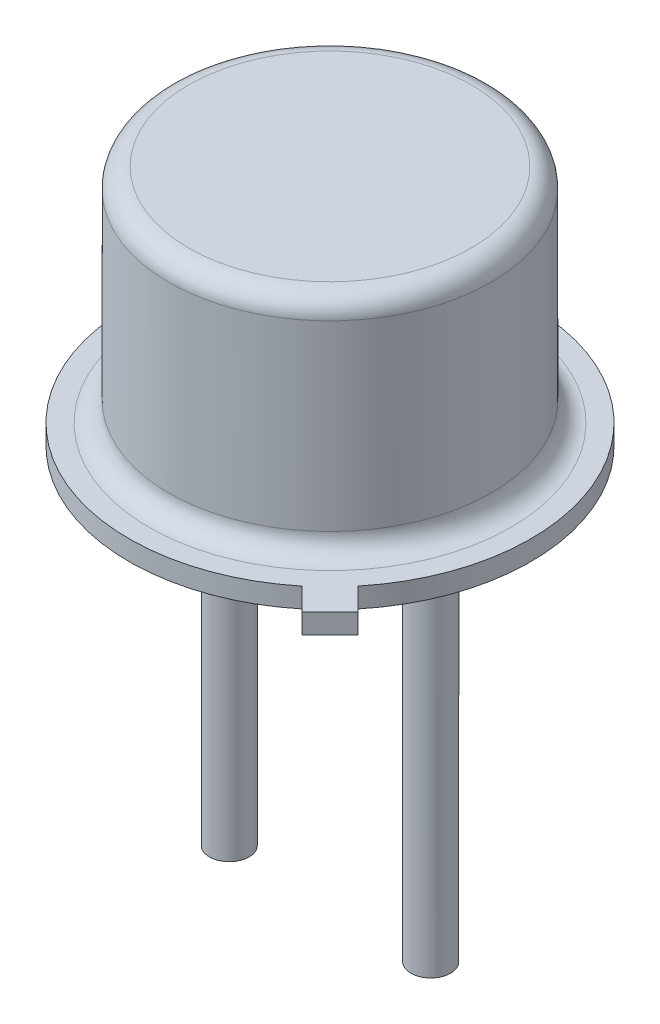
ISO-10303-21;
HEADER;
FILE_DESCRIPTION(('STEP AP214'),'2;1');
FILE_NAME('part.step','',(''),(''),'','','');
FILE_SCHEMA(('AUTOMOTIVE_DESIGN { 1 0 10303 214 1 1 1 1 }'));
ENDSEC;
DATA;
#1=APPLICATION_CONTEXT('core data for automotive mechanical design processes');
#2=APPLICATION_PROTOCOL_DEFINITION('international standard','automotive_design',2000,#1);
#3=PRODUCT_CONTEXT('',#1,'mechanical');
#4=PRODUCT('Part','Part','',(#3));
#5=PRODUCT_RELATED_PRODUCT_CATEGORY('part','',(#4));
#6=PRODUCT_DEFINITION_FORMATION('','',#4);
#7=PRODUCT_DEFINITION_CONTEXT('part definition',#1,'design');
#8=PRODUCT_DEFINITION('design','',#6,#7);
#9=PRODUCT_DEFINITION_SHAPE('','',#8);
#10=(LENGTH_UNIT() NAMED_UNIT(*) SI_UNIT(.MILLI.,.METRE.));
#11=(NAMED_UNIT(*) PLANE_ANGLE_UNIT() SI_UNIT($,.RADIAN.));
#12=(NAMED_UNIT(*) SI_UNIT($,.STERADIAN.) SOLID_ANGLE_UNIT());
#13=UNCERTAINTY_MEASURE_WITH_UNIT(LENGTH_MEASURE(1.E-05),#10,'distance_accuracy_value','');
#14=(GEOMETRIC_REPRESENTATION_CONTEXT(3) GLOBAL_UNCERTAINTY_ASSIGNED_CONTEXT((#13)) GLOBAL_UNIT_ASSIGNED_CONTEXT((#10,
#11,#12)) REPRESENTATION_CONTEXT('',''));
#15=CARTESIAN_POINT('',(0.,0.,0.));
#16=DIRECTION('',(0.,0.,1.));
#17=DIRECTION('',(1.,0.,0.));
#18=AXIS2_PLACEMENT_3D('',#15,#16,#17);
#19=CARTESIAN_POINT('',(-2.54,4.06,0.));
#20=DIRECTION('',(0.,1.,0.));
#21=DIRECTION('',(0.,0.,1.));
#22=AXIS2_PLACEMENT_3D('',#19,#20,#21);
#23=PLANE('',#22);
#24=CARTESIAN_POINT('',(-2.54,4.06,-2.54));
#25=DIRECTION('',(0.,1.,0.));
#26=DIRECTION('',(0.,0.,1.));
#27=AXIS2_PLACEMENT_3D('',#24,#25,#26);
#28=CIRCLE('',#27,0.5);
#29=CARTESIAN_POINT('',(-2.54,4.06,-2.04));
#30=VERTEX_POINT('',#29);
#31=EDGE_CURVE('E122',#30,#30,#28,.F.);
#32=ORIENTED_EDGE('',*,*,#31,.F.);
#33=EDGE_LOOP('',(#32));
#34=FACE_BOUND('',#33,.T.);
#35=CARTESIAN_POINT('',(0.,4.06,0.));
#36=DIRECTION('',(0.,1.,0.));
#37=DIRECTION('',(0.,0.,1.));
#38=AXIS2_PLACEMENT_3D('',#35,#36,#37);
#39=CIRCLE('',#38,0.5);
#40=CARTESIAN_POINT('',(0.,4.06,0.5));
#41=VERTEX_POINT('',#40);
#42=EDGE_CURVE('E119',#41,#41,#39,.F.);
#43=ORIENTED_EDGE('',*,*,#42,.F.);
#44=EDGE_LOOP('',(#43));
#45=FACE_BOUND('',#44,.T.);
#46=CARTESIAN_POINT('',(-5.08,4.06,0.));
#47=DIRECTION('',(0.,1.,0.));
#48=DIRECTION('',(0.,0.,1.));
#49=AXIS2_PLACEMENT_3D('',#46,#47,#48);
#50=CIRCLE('',#49,0.5);
#51=CARTESIAN_POINT('',(-5.08,4.06,0.5));
#52=VERTEX_POINT('',#51);
#53=EDGE_CURVE('E125',#52,#52,#50,.F.);
#54=ORIENTED_EDGE('',*,*,#53,.F.);
#55=EDGE_LOOP('',(#54));
#56=FACE_BOUND('',#55,.T.);
#57=DIRECTION('',(-0.707106781186548,0.,-0.707106781186547));
#58=VECTOR('',#57,1.);
#59=CARTESIAN_POINT('',(1.23613434917003,4.06,4.48324113035658));
#60=LINE('',#59,#58);
#61=CARTESIAN_POINT('',(1.23613434917003,4.06,4.48324113035658));
#62=VERTEX_POINT('',#61);
#63=CARTESIAN_POINT('',(0.670448924220787,4.06,3.91755570540734));
#64=VERTEX_POINT('',#63);
#65=EDGE_CURVE('E99',#62,#64,#60,.T.);
#66=ORIENTED_EDGE('',*,*,#65,.T.);
#67=CARTESIAN_POINT('',(-2.54,4.06,0.));
#68=DIRECTION('',(0.,-1.,0.));
#69=DIRECTION('',(0.,0.,-1.));
#70=AXIS2_PLACEMENT_3D('',#67,#68,#69);
#71=CIRCLE('',#70,5.065);
#72=CARTESIAN_POINT('',(1.37755570540734,4.06,3.21044892422079));
#73=VERTEX_POINT('',#72);
#74=EDGE_CURVE('E102',#64,#73,#71,.T.);
#75=ORIENTED_EDGE('',*,*,#74,.T.);
#76=DIRECTION('',(0.707106781186547,0.,0.707106781186548));
#77=VECTOR('',#76,1.);
#78=CARTESIAN_POINT('',(1.94324113035657,4.06,3.77613434917003));
#79=LINE('',#78,#77);
#80=CARTESIAN_POINT('',(1.94324113035657,4.06,3.77613434917003));
#81=VERTEX_POINT('',#80);
#82=EDGE_CURVE('E84',#73,#81,#79,.T.);
#83=ORIENTED_EDGE('',*,*,#82,.T.);
#84=DIRECTION('',(-0.707106781186547,0.,0.707106781186547));
#85=VECTOR('',#84,1.);
#86=CARTESIAN_POINT('',(1.23613434917003,4.06,4.48324113035658));
#87=LINE('',#86,#85);
#88=EDGE_CURVE('E95',#81,#62,#87,.T.);
#89=ORIENTED_EDGE('',*,*,#88,.T.);
#90=EDGE_LOOP('',(#66,#75,#83,#89));
#91=FACE_BOUND('',#90,.T.);
#92=ADVANCED_FACE('F31',(#34,#45,#56,#91),#23,.F.);
#93=CARTESIAN_POINT('',(0.,-5.94,0.));
#94=DIRECTION('',(0.,1.,0.));
#95=DIRECTION('',(0.,0.,1.));
#96=AXIS2_PLACEMENT_3D('',#93,#94,#95);
#97=CYLINDRICAL_SURFACE('',#96,0.5);
#98=CARTESIAN_POINT('',(0.,-5.94,0.));
#99=DIRECTION('',(0.,-1.,0.));
#100=DIRECTION('',(0.,0.,-1.));
#101=AXIS2_PLACEMENT_3D('',#98,#99,#100);
#102=CIRCLE('',#101,0.5);
#103=CARTESIAN_POINT('',(0.,-5.94,-0.5));
#104=VERTEX_POINT('',#103);
#105=EDGE_CURVE('E116',#104,#104,#102,.T.);
#106=ORIENTED_EDGE('',*,*,#105,.F.);
#107=EDGE_LOOP('',(#106));
#108=FACE_BOUND('',#107,.T.);
#109=ORIENTED_EDGE('',*,*,#42,.T.);
#110=EDGE_LOOP('',(#109));
#111=FACE_BOUND('',#110,.T.);
#112=ADVANCED_FACE('F156',(#108,#111),#97,.T.);
#113=CARTESIAN_POINT('',(0.,-5.94,0.));
#114=DIRECTION('',(0.,-1.,0.));
#115=DIRECTION('',(0.,0.,-1.));
#116=AXIS2_PLACEMENT_3D('',#113,#114,#115);
#117=PLANE('',#116);
#118=ORIENTED_EDGE('',*,*,#105,.T.);
#119=EDGE_LOOP('',(#118));
#120=FACE_BOUND('',#119,.T.);
#121=ADVANCED_FACE('F161',(#120),#117,.T.);
#122=CARTESIAN_POINT('',(-2.54,-5.94,-2.54));
#123=DIRECTION('',(0.,1.,0.));
#124=DIRECTION('',(0.,0.,1.));
#125=AXIS2_PLACEMENT_3D('',#122,#123,#124);
#126=CYLINDRICAL_SURFACE('',#125,0.5);
#127=CARTESIAN_POINT('',(-2.54,-5.94,-2.54));
#128=DIRECTION('',(0.,-1.,0.));
#129=DIRECTION('',(0.,0.,-1.));
#130=AXIS2_PLACEMENT_3D('',#127,#128,#129);
#131=CIRCLE('',#130,0.5);
#132=CARTESIAN_POINT('',(-2.54,-5.94,-3.04));
#133=VERTEX_POINT('',#132);
#134=EDGE_CURVE('E113',#133,#133,#131,.T.);
#135=ORIENTED_EDGE('',*,*,#134,.F.);
#136=EDGE_LOOP('',(#135));
#137=FACE_BOUND('',#136,.T.);
#138=ORIENTED_EDGE('',*,*,#31,.T.);
#139=EDGE_LOOP('',(#138));
#140=FACE_BOUND('',#139,.T.);
#141=ADVANCED_FACE('F192',(#137,#140),#126,.T.);
#142=CARTESIAN_POINT('',(-2.54,-5.94,-2.54));
#143=DIRECTION('',(0.,-1.,0.));
#144=DIRECTION('',(0.,0.,-1.));
#145=AXIS2_PLACEMENT_3D('',#142,#143,#144);
#146=PLANE('',#145);
#147=ORIENTED_EDGE('',*,*,#134,.T.);
#148=EDGE_LOOP('',(#147));
#149=FACE_BOUND('',#148,.T.);
#150=ADVANCED_FACE('F188',(#149),#146,.T.);
#151=CARTESIAN_POINT('',(-5.08,-5.94,0.));
#152=DIRECTION('',(0.,1.,0.));
#153=DIRECTION('',(0.,0.,1.));
#154=AXIS2_PLACEMENT_3D('',#151,#152,#153);
#155=CYLINDRICAL_SURFACE('',#154,0.5);
#156=CARTESIAN_POINT('',(-5.08,-5.94,0.));
#157=DIRECTION('',(0.,-1.,0.));
#158=DIRECTION('',(0.,0.,1.));
#159=AXIS2_PLACEMENT_3D('',#156,#157,#158);
#160=CIRCLE('',#159,0.5);
#161=CARTESIAN_POINT('',(-5.08,-5.94,0.5));
#162=VERTEX_POINT('',#161);
#163=EDGE_CURVE('E108',#162,#162,#160,.T.);
#164=ORIENTED_EDGE('',*,*,#163,.F.);
#165=EDGE_LOOP('',(#164));
#166=FACE_BOUND('',#165,.T.);
#167=ORIENTED_EDGE('',*,*,#53,.T.);
#168=EDGE_LOOP('',(#167));
#169=FACE_BOUND('',#168,.T.);
#170=ADVANCED_FACE('F184',(#166,#169),#155,.T.);
#171=CARTESIAN_POINT('',(-5.08,-5.94,0.));
#172=DIRECTION('',(0.,1.,0.));
#173=DIRECTION('',(0.,0.,1.));
#174=AXIS2_PLACEMENT_3D('',#171,#172,#173);
#175=PLANE('',#174);
#176=ORIENTED_EDGE('',*,*,#163,.T.);
#177=EDGE_LOOP('',(#176));
#178=FACE_BOUND('',#177,.T.);
#179=ADVANCED_FACE('F181',(#178),#175,.F.);
#180=CARTESIAN_POINT('',(-2.54,4.56,0.));
#181=DIRECTION('',(0.,-1.,0.));
#182=DIRECTION('',(0.,0.,-1.));
#183=AXIS2_PLACEMENT_3D('',#180,#181,#182);
#184=PLANE('',#183);
#185=CARTESIAN_POINT('',(-2.54,4.56,0.));
#186=DIRECTION('',(0.,-1.,0.));
#187=DIRECTION('',(0.,0.,-1.));
#188=AXIS2_PLACEMENT_3D('',#185,#186,#187);
#189=CIRCLE('',#188,4.564);
#190=CARTESIAN_POINT('',(-2.54,4.56,-4.564));
#191=VERTEX_POINT('',#190);
#192=EDGE_CURVE('E11',#191,#191,#189,.T.);
#193=ORIENTED_EDGE('',*,*,#192,.T.);
#194=EDGE_LOOP('',(#193));
#195=FACE_BOUND('',#194,.T.);
#196=DIRECTION('',(-0.707106781186548,0.,-0.707106781186547));
#197=VECTOR('',#196,1.);
#198=CARTESIAN_POINT('',(1.23613434917003,4.56,4.48324113035658));
#199=LINE('',#198,#197);
#200=CARTESIAN_POINT('',(1.23613434917003,4.56,4.48324113035658));
#201=VERTEX_POINT('',#200);
#202=CARTESIAN_POINT('',(0.670448924220787,4.56,3.91755570540734));
#203=VERTEX_POINT('',#202);
#204=EDGE_CURVE('E93',#201,#203,#199,.T.);
#205=ORIENTED_EDGE('',*,*,#204,.F.);
#206=DIRECTION('',(-0.707106781186547,0.,0.707106781186547));
#207=VECTOR('',#206,1.);
#208=CARTESIAN_POINT('',(1.23613434917003,4.56,4.48324113035658));
#209=LINE('',#208,#207);
#210=CARTESIAN_POINT('',(1.94324113035657,4.56,3.77613434917003));
#211=VERTEX_POINT('',#210);
#212=EDGE_CURVE('E90',#211,#201,#209,.T.);
#213=ORIENTED_EDGE('',*,*,#212,.F.);
#214=DIRECTION('',(0.707106781186547,0.,0.707106781186548));
#215=VECTOR('',#214,1.);
#216=CARTESIAN_POINT('',(1.94324113035657,4.56,3.77613434917003));
#217=LINE('',#216,#215);
#218=CARTESIAN_POINT('',(1.37755570540734,4.56,3.21044892422079));
#219=VERTEX_POINT('',#218);
#220=EDGE_CURVE('E82',#219,#211,#217,.T.);
#221=ORIENTED_EDGE('',*,*,#220,.F.);
#222=CARTESIAN_POINT('',(-2.54,4.56,0.));
#223=DIRECTION('',(0.,-1.,0.));
#224=DIRECTION('',(0.,0.,-1.));
#225=AXIS2_PLACEMENT_3D('',#222,#223,#224);
#226=CIRCLE('',#225,5.065);
#227=EDGE_CURVE('E89',#203,#219,#226,.T.);
#228=ORIENTED_EDGE('',*,*,#227,.F.);
#229=EDGE_LOOP('',(#205,#213,#221,#228));
#230=FACE_BOUND('',#229,.T.);
#231=ADVANCED_FACE('F88',(#195,#230),#184,.F.);
#232=CARTESIAN_POINT('',(1.23613434917003,4.56,4.48324113035658));
#233=DIRECTION('',(-0.707106781186547,0.,0.707106781186548));
#234=DIRECTION('',(0.707106781186548,0.,0.707106781186547));
#235=AXIS2_PLACEMENT_3D('',#232,#233,#234);
#236=PLANE('',#235);
#237=ORIENTED_EDGE('',*,*,#65,.F.);
#238=DIRECTION('',(0.,-1.,0.));
#239=VECTOR('',#238,1.);
#240=CARTESIAN_POINT('',(1.23613434917003,4.56,4.48324113035658));
#241=LINE('',#240,#239);
#242=EDGE_CURVE('E48',#201,#62,#241,.T.);
#243=ORIENTED_EDGE('',*,*,#242,.F.);
#244=ORIENTED_EDGE('',*,*,#204,.T.);
#245=DIRECTION('',(0.,-1.,0.));
#246=VECTOR('',#245,1.);
#247=CARTESIAN_POINT('',(0.670448924220787,4.56,3.91755570540734));
#248=LINE('',#247,#246);
#249=EDGE_CURVE('E76',#203,#64,#248,.T.);
#250=ORIENTED_EDGE('',*,*,#249,.T.);
#251=EDGE_LOOP('',(#237,#243,#244,#250));
#252=FACE_BOUND('',#251,.T.);
#253=ADVANCED_FACE('F169',(#252),#236,.T.);
#254=CARTESIAN_POINT('',(1.23613434917003,4.56,4.48324113035658));
#255=DIRECTION('',(0.707106781186547,0.,0.707106781186547));
#256=DIRECTION('',(0.707106781186548,0.,-0.707106781186548));
#257=AXIS2_PLACEMENT_3D('',#254,#255,#256);
#258=PLANE('',#257);
#259=ORIENTED_EDGE('',*,*,#88,.F.);
#260=DIRECTION('',(0.,-1.,0.));
#261=VECTOR('',#260,1.);
#262=CARTESIAN_POINT('',(1.94324113035657,4.56,3.77613434917003));
#263=LINE('',#262,#261);
#264=EDGE_CURVE('E65',#211,#81,#263,.T.);
#265=ORIENTED_EDGE('',*,*,#264,.F.);
#266=ORIENTED_EDGE('',*,*,#212,.T.);
#267=ORIENTED_EDGE('',*,*,#242,.T.);
#268=EDGE_LOOP('',(#259,#265,#266,#267));
#269=FACE_BOUND('',#268,.T.);
#270=ADVANCED_FACE('F170',(#269),#258,.T.);
#271=CARTESIAN_POINT('',(1.94324113035657,4.56,3.77613434917003));
#272=DIRECTION('',(0.707106781186548,0.,-0.707106781186547));
#273=DIRECTION('',(-0.707106781186547,0.,-0.707106781186548));
#274=AXIS2_PLACEMENT_3D('',#271,#272,#273);
#275=PLANE('',#274);
#276=ORIENTED_EDGE('',*,*,#82,.F.);
#277=DIRECTION('',(0.,-1.,0.));
#278=VECTOR('',#277,1.);
#279=CARTESIAN_POINT('',(1.37755570540734,4.56,3.21044892422079));
#280=LINE('',#279,#278);
#281=EDGE_CURVE('E79',#219,#73,#280,.T.);
#282=ORIENTED_EDGE('',*,*,#281,.F.);
#283=ORIENTED_EDGE('',*,*,#220,.T.);
#284=ORIENTED_EDGE('',*,*,#264,.T.);
#285=EDGE_LOOP('',(#276,#282,#283,#284));
#286=FACE_BOUND('',#285,.T.);
#287=ADVANCED_FACE('F81',(#286),#275,.T.);
#288=CARTESIAN_POINT('',(-2.54,4.56,0.));
#289=DIRECTION('',(0.,-1.,0.));
#290=DIRECTION('',(0.,0.,-1.));
#291=AXIS2_PLACEMENT_3D('',#288,#289,#290);
#292=CYLINDRICAL_SURFACE('',#291,5.065);
#293=ORIENTED_EDGE('',*,*,#74,.F.);
#294=ORIENTED_EDGE('',*,*,#249,.F.);
#295=ORIENTED_EDGE('',*,*,#227,.T.);
#296=ORIENTED_EDGE('',*,*,#281,.T.);
#297=EDGE_LOOP('',(#293,#294,#295,#296));
#298=FACE_BOUND('',#297,.T.);
#299=ADVANCED_FACE('F92',(#298),#292,.T.);
#300=CARTESIAN_POINT('',(-2.54,10.16,0.));
#301=DIRECTION('',(0.,1.,0.));
#302=DIRECTION('',(0.,0.,1.));
#303=AXIS2_PLACEMENT_3D('',#300,#301,#302);
#304=PLANE('',#303);
#305=CARTESIAN_POINT('',(-2.54,10.16,0.));
#306=DIRECTION('',(0.,1.,0.));
#307=DIRECTION('',(0.,0.,1.));
#308=AXIS2_PLACEMENT_3D('',#305,#306,#307);
#309=CIRCLE('',#308,3.564);
#310=CARTESIAN_POINT('',(-2.54,10.16,3.564));
#311=VERTEX_POINT('',#310);
#312=EDGE_CURVE('E128',#311,#311,#309,.T.);
#313=ORIENTED_EDGE('',*,*,#312,.T.);
#314=EDGE_LOOP('',(#313));
#315=FACE_BOUND('',#314,.T.);
#316=ADVANCED_FACE('F144',(#315),#304,.T.);
#317=CARTESIAN_POINT('',(-2.54,10.16,0.));
#318=DIRECTION('',(0.,-1.,0.));
#319=DIRECTION('',(0.,0.,-1.));
#320=AXIS2_PLACEMENT_3D('',#317,#318,#319);
#321=CYLINDRICAL_SURFACE('',#320,4.064);
#322=CARTESIAN_POINT('',(-2.54,9.66,0.));
#323=DIRECTION('',(0.,1.,0.));
#324=DIRECTION('',(0.,0.,1.));
#325=AXIS2_PLACEMENT_3D('',#322,#323,#324);
#326=CIRCLE('',#325,4.064);
#327=CARTESIAN_POINT('',(-2.54,9.66,4.064));
#328=VERTEX_POINT('',#327);
#329=EDGE_CURVE('E40',#328,#328,#326,.F.);
#330=ORIENTED_EDGE('',*,*,#329,.T.);
#331=EDGE_LOOP('',(#330));
#332=FACE_BOUND('',#331,.T.);
#333=CARTESIAN_POINT('',(-2.54,5.06,0.));
#334=DIRECTION('',(0.,-1.,0.));
#335=DIRECTION('',(0.,0.,-1.));
#336=AXIS2_PLACEMENT_3D('',#333,#334,#335);
#337=CIRCLE('',#336,4.064);
#338=CARTESIAN_POINT('',(-2.54,5.06,-4.064));
#339=VERTEX_POINT('',#338);
#340=EDGE_CURVE('E131',#339,#339,#337,.F.);
#341=ORIENTED_EDGE('',*,*,#340,.T.);
#342=EDGE_LOOP('',(#341));
#343=FACE_BOUND('',#342,.T.);
#344=ADVANCED_FACE('F136',(#332,#343),#321,.T.);
#345=CARTESIAN_POINT('',(-2.54,9.66,0.));
#346=DIRECTION('',(0.,1.,0.));
#347=DIRECTION('',(0.,0.,1.));
#348=AXIS2_PLACEMENT_3D('',#345,#346,#347);
#349=TOROIDAL_SURFACE('',#348,3.564,0.5);
#350=ORIENTED_EDGE('',*,*,#329,.F.);
#351=EDGE_LOOP('',(#350));
#352=FACE_BOUND('',#351,.T.);
#353=ORIENTED_EDGE('',*,*,#312,.F.);
#354=EDGE_LOOP('',(#353));
#355=FACE_BOUND('',#354,.T.);
#356=ADVANCED_FACE('F139',(#352,#355),#349,.T.);
#357=CARTESIAN_POINT('',(-2.54,5.06,0.));
#358=DIRECTION('',(0.,-1.,0.));
#359=DIRECTION('',(0.,0.,-1.));
#360=AXIS2_PLACEMENT_3D('',#357,#358,#359);
#361=TOROIDAL_SURFACE('',#360,4.564,0.5);
#362=ORIENTED_EDGE('',*,*,#340,.F.);
#363=EDGE_LOOP('',(#362));
#364=FACE_BOUND('',#363,.T.);
#365=ORIENTED_EDGE('',*,*,#192,.F.);
#366=EDGE_LOOP('',(#365));
#367=FACE_BOUND('',#366,.T.);
#368=ADVANCED_FACE('F33',(#364,#367),#361,.F.);
#369=CLOSED_SHELL('',(#92,#112,#121,#141,#150,#170,#179,#231,#253,#270,#287,#299,#316,#344,#356,#368));
#370=MANIFOLD_SOLID_BREP('B2',#369);
#371=ADVANCED_BREP_SHAPE_REPRESENTATION('',(#18,#370),#14);
#372=SHAPE_DEFINITION_REPRESENTATION(#9,#371);
ENDSEC;
END-ISO-10303-21;
